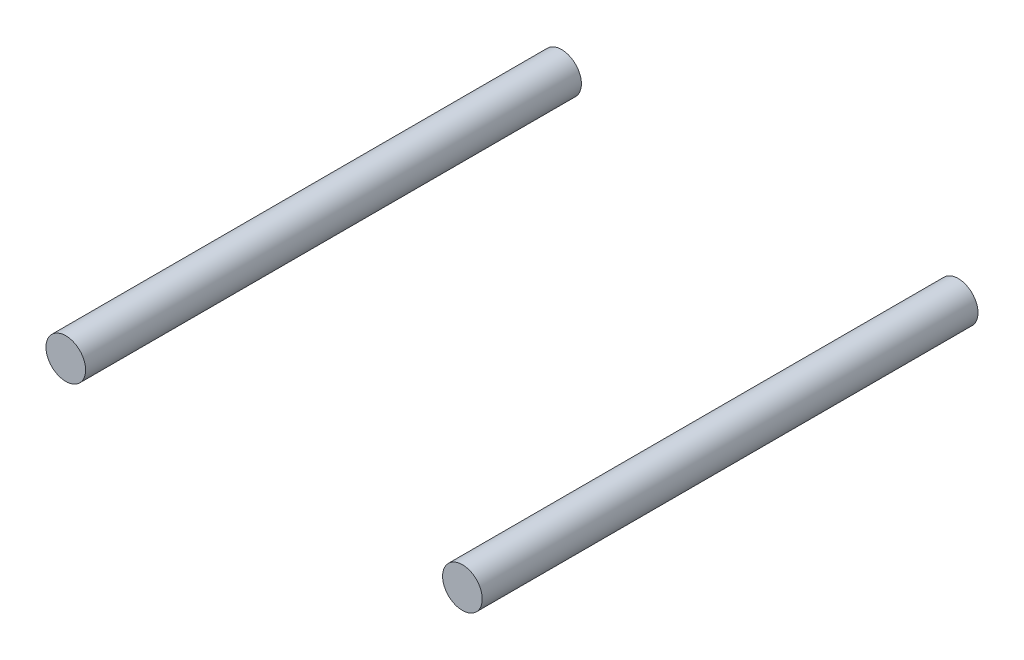
ISO-10303-21;
HEADER;
FILE_DESCRIPTION(('STEP AP214'),'2;1');
FILE_NAME('part.step','',(''),(''),'','','');
FILE_SCHEMA(('AUTOMOTIVE_DESIGN { 1 0 10303 214 1 1 1 1 }'));
ENDSEC;
DATA;
#1=APPLICATION_CONTEXT('core data for automotive mechanical design processes');
#2=APPLICATION_PROTOCOL_DEFINITION('international standard','automotive_design',2000,#1);
#3=PRODUCT_CONTEXT('',#1,'mechanical');
#4=PRODUCT('Part','Part','',(#3));
#5=PRODUCT_RELATED_PRODUCT_CATEGORY('part','',(#4));
#6=PRODUCT_DEFINITION_FORMATION('','',#4);
#7=PRODUCT_DEFINITION_CONTEXT('part definition',#1,'design');
#8=PRODUCT_DEFINITION('design','',#6,#7);
#9=PRODUCT_DEFINITION_SHAPE('','',#8);
#10=(LENGTH_UNIT() NAMED_UNIT(*) SI_UNIT(.MILLI.,.METRE.));
#11=(NAMED_UNIT(*) PLANE_ANGLE_UNIT() SI_UNIT($,.RADIAN.));
#12=(NAMED_UNIT(*) SI_UNIT($,.STERADIAN.) SOLID_ANGLE_UNIT());
#13=UNCERTAINTY_MEASURE_WITH_UNIT(LENGTH_MEASURE(1.E-05),#10,'distance_accuracy_value','');
#14=(GEOMETRIC_REPRESENTATION_CONTEXT(3) GLOBAL_UNCERTAINTY_ASSIGNED_CONTEXT((#13)) GLOBAL_UNIT_ASSIGNED_CONTEXT((#10,
#11,#12)) REPRESENTATION_CONTEXT('',''));
#15=CARTESIAN_POINT('',(0.,0.,0.));
#16=DIRECTION('',(0.,0.,1.));
#17=DIRECTION('',(1.,0.,0.));
#18=AXIS2_PLACEMENT_3D('',#15,#16,#17);
#19=CARTESIAN_POINT('',(4.,0.,5.));
#20=DIRECTION('',(0.,0.,-1.));
#21=DIRECTION('',(-1.,0.,0.));
#22=AXIS2_PLACEMENT_3D('',#19,#20,#21);
#23=CYLINDRICAL_SURFACE('',#22,0.4);
#24=CARTESIAN_POINT('',(4.,0.,5.));
#25=DIRECTION('',(0.,0.,1.));
#26=DIRECTION('',(1.,0.,0.));
#27=AXIS2_PLACEMENT_3D('',#24,#25,#26);
#28=CIRCLE('',#27,0.4);
#29=CARTESIAN_POINT('',(4.4,0.,5.));
#30=VERTEX_POINT('',#29);
#31=EDGE_CURVE('E11',#30,#30,#28,.T.);
#32=ORIENTED_EDGE('',*,*,#31,.F.);
#33=EDGE_LOOP('',(#32));
#34=FACE_BOUND('',#33,.T.);
#35=CARTESIAN_POINT('',(4.,0.,-5.));
#36=DIRECTION('',(0.,0.,1.));
#37=DIRECTION('',(1.,0.,0.));
#38=AXIS2_PLACEMENT_3D('',#35,#36,#37);
#39=CIRCLE('',#38,0.4);
#40=CARTESIAN_POINT('',(4.4,0.,-5.));
#41=VERTEX_POINT('',#40);
#42=EDGE_CURVE('E41',#41,#41,#39,.T.);
#43=ORIENTED_EDGE('',*,*,#42,.T.);
#44=EDGE_LOOP('',(#43));
#45=FACE_BOUND('',#44,.T.);
#46=ADVANCED_FACE('F38',(#34,#45),#23,.T.);
#47=CARTESIAN_POINT('',(4.,0.,5.));
#48=DIRECTION('',(0.,0.,1.));
#49=DIRECTION('',(1.,0.,0.));
#50=AXIS2_PLACEMENT_3D('',#47,#48,#49);
#51=PLANE('',#50);
#52=ORIENTED_EDGE('',*,*,#31,.T.);
#53=EDGE_LOOP('',(#52));
#54=FACE_BOUND('',#53,.T.);
#55=ADVANCED_FACE('F53',(#54),#51,.T.);
#56=CARTESIAN_POINT('',(4.,0.,-5.));
#57=DIRECTION('',(0.,0.,1.));
#58=DIRECTION('',(1.,0.,0.));
#59=AXIS2_PLACEMENT_3D('',#56,#57,#58);
#60=PLANE('',#59);
#61=ORIENTED_EDGE('',*,*,#42,.F.);
#62=EDGE_LOOP('',(#61));
#63=FACE_BOUND('',#62,.T.);
#64=ADVANCED_FACE('F51',(#63),#60,.F.);
#65=CLOSED_SHELL('',(#46,#55,#64));
#66=MANIFOLD_SOLID_BREP('B2',#65);
#67=CARTESIAN_POINT('',(-4.,0.,5.));
#68=DIRECTION('',(0.,0.,-1.));
#69=DIRECTION('',(-1.,0.,0.));
#70=AXIS2_PLACEMENT_3D('',#67,#68,#69);
#71=CYLINDRICAL_SURFACE('',#70,0.4);
#72=CARTESIAN_POINT('',(-4.,0.,5.));
#73=DIRECTION('',(0.,0.,1.));
#74=DIRECTION('',(1.,0.,0.));
#75=AXIS2_PLACEMENT_3D('',#72,#73,#74);
#76=CIRCLE('',#75,0.4);
#77=CARTESIAN_POINT('',(-3.6,0.,5.));
#78=VERTEX_POINT('',#77);
#79=EDGE_CURVE('E37',#78,#78,#76,.T.);
#80=ORIENTED_EDGE('',*,*,#79,.F.);
#81=EDGE_LOOP('',(#80));
#82=FACE_BOUND('',#81,.T.);
#83=CARTESIAN_POINT('',(-4.,0.,-5.));
#84=DIRECTION('',(0.,0.,1.));
#85=DIRECTION('',(1.,0.,0.));
#86=AXIS2_PLACEMENT_3D('',#83,#84,#85);
#87=CIRCLE('',#86,0.4);
#88=CARTESIAN_POINT('',(-3.6,0.,-5.));
#89=VERTEX_POINT('',#88);
#90=EDGE_CURVE('E81',#89,#89,#87,.T.);
#91=ORIENTED_EDGE('',*,*,#90,.T.);
#92=EDGE_LOOP('',(#91));
#93=FACE_BOUND('',#92,.T.);
#94=ADVANCED_FACE('F78',(#82,#93),#71,.T.);
#95=CARTESIAN_POINT('',(-4.,0.,5.));
#96=DIRECTION('',(0.,0.,1.));
#97=DIRECTION('',(1.,0.,0.));
#98=AXIS2_PLACEMENT_3D('',#95,#96,#97);
#99=PLANE('',#98);
#100=ORIENTED_EDGE('',*,*,#79,.T.);
#101=EDGE_LOOP('',(#100));
#102=FACE_BOUND('',#101,.T.);
#103=ADVANCED_FACE('F93',(#102),#99,.T.);
#104=CARTESIAN_POINT('',(-4.,0.,-5.));
#105=DIRECTION('',(0.,0.,1.));
#106=DIRECTION('',(1.,0.,0.));
#107=AXIS2_PLACEMENT_3D('',#104,#105,#106);
#108=PLANE('',#107);
#109=ORIENTED_EDGE('',*,*,#90,.F.);
#110=EDGE_LOOP('',(#109));
#111=FACE_BOUND('',#110,.T.);
#112=ADVANCED_FACE('F91',(#111),#108,.F.);
#113=CLOSED_SHELL('',(#94,#103,#112));
#114=MANIFOLD_SOLID_BREP('B6',#113);
#115=ADVANCED_BREP_SHAPE_REPRESENTATION('',(#18,#66,#114),#14);
#116=SHAPE_DEFINITION_REPRESENTATION(#9,#115);
ENDSEC;
END-ISO-10303-21;
